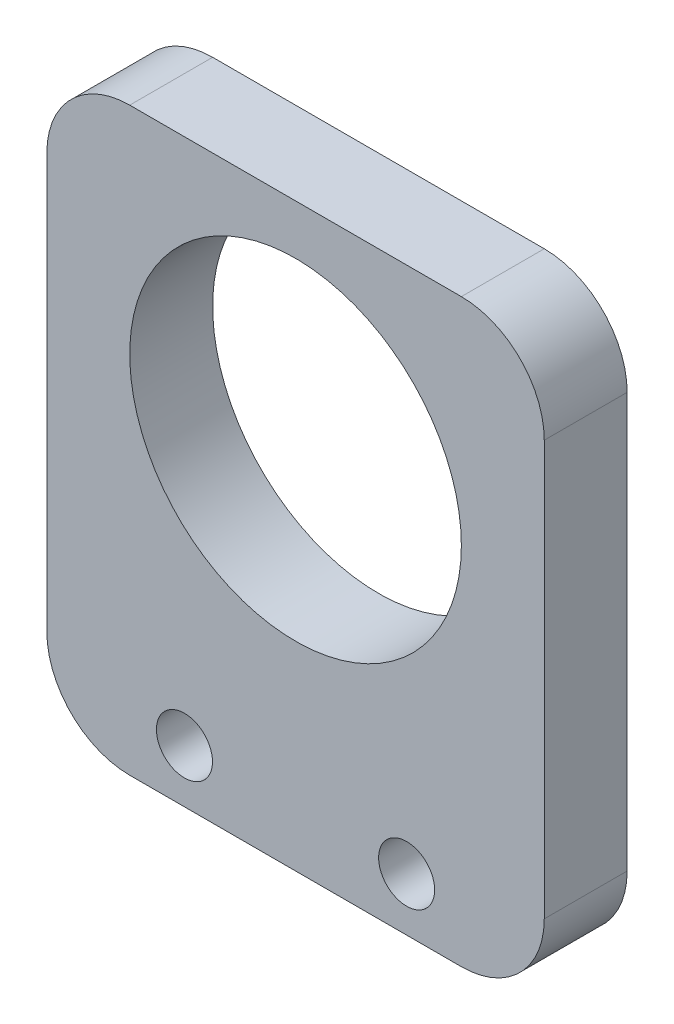
ISO-10303-21;
HEADER;
FILE_DESCRIPTION(('STEP AP214'),'2;1');
FILE_NAME('part.step','',(''),(''),'','','');
FILE_SCHEMA(('AUTOMOTIVE_DESIGN { 1 0 10303 214 1 1 1 1 }'));
ENDSEC;
DATA;
#1=APPLICATION_CONTEXT('core data for automotive mechanical design processes');
#2=APPLICATION_PROTOCOL_DEFINITION('international standard','automotive_design',2000,#1);
#3=PRODUCT_CONTEXT('',#1,'mechanical');
#4=PRODUCT('Part','Part','',(#3));
#5=PRODUCT_RELATED_PRODUCT_CATEGORY('part','',(#4));
#6=PRODUCT_DEFINITION_FORMATION('','',#4);
#7=PRODUCT_DEFINITION_CONTEXT('part definition',#1,'design');
#8=PRODUCT_DEFINITION('design','',#6,#7);
#9=PRODUCT_DEFINITION_SHAPE('','',#8);
#10=(LENGTH_UNIT() NAMED_UNIT(*) SI_UNIT(.MILLI.,.METRE.));
#11=(NAMED_UNIT(*) PLANE_ANGLE_UNIT() SI_UNIT($,.RADIAN.));
#12=(NAMED_UNIT(*) SI_UNIT($,.STERADIAN.) SOLID_ANGLE_UNIT());
#13=UNCERTAINTY_MEASURE_WITH_UNIT(LENGTH_MEASURE(1.E-05),#10,'distance_accuracy_value','');
#14=(GEOMETRIC_REPRESENTATION_CONTEXT(3) GLOBAL_UNCERTAINTY_ASSIGNED_CONTEXT((#13)) GLOBAL_UNIT_ASSIGNED_CONTEXT((#10,
#11,#12)) REPRESENTATION_CONTEXT('',''));
#15=CARTESIAN_POINT('',(0.,0.,0.));
#16=DIRECTION('',(0.,0.,1.));
#17=DIRECTION('',(1.,0.,0.));
#18=AXIS2_PLACEMENT_3D('',#15,#16,#17);
#19=CARTESIAN_POINT('',(0.,0.,6.35));
#20=DIRECTION('',(0.,0.,1.));
#21=DIRECTION('',(1.,0.,0.));
#22=AXIS2_PLACEMENT_3D('',#19,#20,#21);
#23=PLANE('',#22);
#24=CARTESIAN_POINT('',(8.50899999999999,4.064,6.35));
#25=DIRECTION('',(0.,0.,1.));
#26=DIRECTION('',(1.,0.,0.));
#27=AXIS2_PLACEMENT_3D('',#24,#25,#26);
#28=CIRCLE('',#27,2.1463);
#29=CARTESIAN_POINT('',(10.6553,4.064,6.35));
#30=VERTEX_POINT('',#29);
#31=EDGE_CURVE('E183',#30,#30,#28,.T.);
#32=ORIENTED_EDGE('',*,*,#31,.F.);
#33=EDGE_LOOP('',(#32));
#34=FACE_BOUND('',#33,.T.);
#35=DIRECTION('',(-1.,0.,0.));
#36=VECTOR('',#35,1.);
#37=CARTESIAN_POINT('',(19.05,44.45,6.35));
#38=LINE('',#37,#36);
#39=CARTESIAN_POINT('',(12.7,44.45,6.35));
#40=VERTEX_POINT('',#39);
#41=CARTESIAN_POINT('',(-12.7,44.45,6.35));
#42=VERTEX_POINT('',#41);
#43=EDGE_CURVE('E169',#40,#42,#38,.T.);
#44=ORIENTED_EDGE('',*,*,#43,.T.);
#45=CARTESIAN_POINT('',(-12.7,38.1,6.35));
#46=DIRECTION('',(0.,0.,1.));
#47=DIRECTION('',(1.,0.,0.));
#48=AXIS2_PLACEMENT_3D('',#45,#46,#47);
#49=CIRCLE('',#48,6.35);
#50=CARTESIAN_POINT('',(-19.05,38.1,6.35));
#51=VERTEX_POINT('',#50);
#52=EDGE_CURVE('E150',#42,#51,#49,.T.);
#53=ORIENTED_EDGE('',*,*,#52,.T.);
#54=DIRECTION('',(0.,-1.,0.));
#55=VECTOR('',#54,1.);
#56=CARTESIAN_POINT('',(-19.05,0.,6.35));
#57=LINE('',#56,#55);
#58=CARTESIAN_POINT('',(-19.05,6.35,6.35));
#59=VERTEX_POINT('',#58);
#60=EDGE_CURVE('E120',#51,#59,#57,.T.);
#61=ORIENTED_EDGE('',*,*,#60,.T.);
#62=CARTESIAN_POINT('',(-12.7,6.35,6.35));
#63=DIRECTION('',(0.,0.,1.));
#64=DIRECTION('',(1.,0.,0.));
#65=AXIS2_PLACEMENT_3D('',#62,#63,#64);
#66=CIRCLE('',#65,6.35);
#67=CARTESIAN_POINT('',(-12.7,0.,6.35));
#68=VERTEX_POINT('',#67);
#69=EDGE_CURVE('E56',#59,#68,#66,.T.);
#70=ORIENTED_EDGE('',*,*,#69,.T.);
#71=DIRECTION('',(1.,0.,0.));
#72=VECTOR('',#71,1.);
#73=CARTESIAN_POINT('',(-19.05,0.,6.35));
#74=LINE('',#73,#72);
#75=CARTESIAN_POINT('',(12.7,0.,6.35));
#76=VERTEX_POINT('',#75);
#77=EDGE_CURVE('E136',#68,#76,#74,.T.);
#78=ORIENTED_EDGE('',*,*,#77,.T.);
#79=CARTESIAN_POINT('',(12.7,6.35,6.35));
#80=DIRECTION('',(0.,0.,1.));
#81=DIRECTION('',(1.,0.,0.));
#82=AXIS2_PLACEMENT_3D('',#79,#80,#81);
#83=CIRCLE('',#82,6.35);
#84=CARTESIAN_POINT('',(19.05,6.35,6.35));
#85=VERTEX_POINT('',#84);
#86=EDGE_CURVE('E147',#76,#85,#83,.T.);
#87=ORIENTED_EDGE('',*,*,#86,.T.);
#88=DIRECTION('',(0.,1.,0.));
#89=VECTOR('',#88,1.);
#90=CARTESIAN_POINT('',(19.05,0.,6.35));
#91=LINE('',#90,#89);
#92=CARTESIAN_POINT('',(19.05,38.1,6.35));
#93=VERTEX_POINT('',#92);
#94=EDGE_CURVE('E130',#85,#93,#91,.T.);
#95=ORIENTED_EDGE('',*,*,#94,.T.);
#96=CARTESIAN_POINT('',(12.7,38.1,6.35));
#97=DIRECTION('',(0.,0.,1.));
#98=DIRECTION('',(1.,0.,0.));
#99=AXIS2_PLACEMENT_3D('',#96,#97,#98);
#100=CIRCLE('',#99,6.35);
#101=EDGE_CURVE('E145',#93,#40,#100,.T.);
#102=ORIENTED_EDGE('',*,*,#101,.T.);
#103=EDGE_LOOP('',(#44,#53,#61,#70,#78,#87,#95,#102));
#104=FACE_BOUND('',#103,.T.);
#105=CARTESIAN_POINT('',(1.11022302462516E-13,27.9399999999997,6.35));
#106=DIRECTION('',(0.,0.,1.));
#107=DIRECTION('',(1.,0.,0.));
#108=AXIS2_PLACEMENT_3D('',#105,#106,#107);
#109=CIRCLE('',#108,12.6999999999999);
#110=CARTESIAN_POINT('',(12.7,27.9399999999997,6.35));
#111=VERTEX_POINT('',#110);
#112=EDGE_CURVE('E174',#111,#111,#109,.T.);
#113=ORIENTED_EDGE('',*,*,#112,.F.);
#114=EDGE_LOOP('',(#113));
#115=FACE_BOUND('',#114,.T.);
#116=CARTESIAN_POINT('',(-8.50900000000001,4.064,6.35));
#117=DIRECTION('',(0.,0.,1.));
#118=DIRECTION('',(1.,0.,0.));
#119=AXIS2_PLACEMENT_3D('',#116,#117,#118);
#120=CIRCLE('',#119,2.1463);
#121=CARTESIAN_POINT('',(-6.36270000000001,4.064,6.35));
#122=VERTEX_POINT('',#121);
#123=EDGE_CURVE('E188',#122,#122,#120,.T.);
#124=ORIENTED_EDGE('',*,*,#123,.F.);
#125=EDGE_LOOP('',(#124));
#126=FACE_BOUND('',#125,.T.);
#127=ADVANCED_FACE('F34',(#34,#104,#115,#126),#23,.T.);
#128=CARTESIAN_POINT('',(0.,0.,0.));
#129=DIRECTION('',(0.,0.,1.));
#130=DIRECTION('',(1.,0.,0.));
#131=AXIS2_PLACEMENT_3D('',#128,#129,#130);
#132=PLANE('',#131);
#133=DIRECTION('',(0.,-1.,0.));
#134=VECTOR('',#133,1.);
#135=CARTESIAN_POINT('',(-19.05,0.,0.));
#136=LINE('',#135,#134);
#137=CARTESIAN_POINT('',(-19.05,38.1,0.));
#138=VERTEX_POINT('',#137);
#139=CARTESIAN_POINT('',(-19.05,6.35,0.));
#140=VERTEX_POINT('',#139);
#141=EDGE_CURVE('E118',#138,#140,#136,.T.);
#142=ORIENTED_EDGE('',*,*,#141,.F.);
#143=CARTESIAN_POINT('',(-12.7,38.1,0.));
#144=DIRECTION('',(0.,0.,1.));
#145=DIRECTION('',(1.,0.,0.));
#146=AXIS2_PLACEMENT_3D('',#143,#144,#145);
#147=CIRCLE('',#146,6.35);
#148=CARTESIAN_POINT('',(-12.7,44.45,0.));
#149=VERTEX_POINT('',#148);
#150=EDGE_CURVE('E101',#138,#149,#147,.F.);
#151=ORIENTED_EDGE('',*,*,#150,.T.);
#152=DIRECTION('',(-1.,0.,0.));
#153=VECTOR('',#152,1.);
#154=CARTESIAN_POINT('',(19.05,44.45,0.));
#155=LINE('',#154,#153);
#156=CARTESIAN_POINT('',(12.7,44.45,0.));
#157=VERTEX_POINT('',#156);
#158=EDGE_CURVE('E128',#157,#149,#155,.T.);
#159=ORIENTED_EDGE('',*,*,#158,.F.);
#160=CARTESIAN_POINT('',(12.7,38.1,0.));
#161=DIRECTION('',(0.,0.,1.));
#162=DIRECTION('',(1.,0.,0.));
#163=AXIS2_PLACEMENT_3D('',#160,#161,#162);
#164=CIRCLE('',#163,6.35);
#165=CARTESIAN_POINT('',(19.05,38.1,0.));
#166=VERTEX_POINT('',#165);
#167=EDGE_CURVE('E121',#157,#166,#164,.F.);
#168=ORIENTED_EDGE('',*,*,#167,.T.);
#169=DIRECTION('',(0.,1.,0.));
#170=VECTOR('',#169,1.);
#171=CARTESIAN_POINT('',(19.05,0.,0.));
#172=LINE('',#171,#170);
#173=CARTESIAN_POINT('',(19.05,6.35,0.));
#174=VERTEX_POINT('',#173);
#175=EDGE_CURVE('E132',#174,#166,#172,.T.);
#176=ORIENTED_EDGE('',*,*,#175,.F.);
#177=CARTESIAN_POINT('',(12.7,6.35,0.));
#178=DIRECTION('',(0.,0.,1.));
#179=DIRECTION('',(1.,0.,0.));
#180=AXIS2_PLACEMENT_3D('',#177,#178,#179);
#181=CIRCLE('',#180,6.35);
#182=CARTESIAN_POINT('',(12.7,0.,0.));
#183=VERTEX_POINT('',#182);
#184=EDGE_CURVE('E139',#174,#183,#181,.F.);
#185=ORIENTED_EDGE('',*,*,#184,.T.);
#186=DIRECTION('',(1.,0.,0.));
#187=VECTOR('',#186,1.);
#188=CARTESIAN_POINT('',(-19.05,0.,0.));
#189=LINE('',#188,#187);
#190=CARTESIAN_POINT('',(-12.7,0.,0.));
#191=VERTEX_POINT('',#190);
#192=EDGE_CURVE('E127',#191,#183,#189,.T.);
#193=ORIENTED_EDGE('',*,*,#192,.F.);
#194=CARTESIAN_POINT('',(-12.7,6.35,0.));
#195=DIRECTION('',(0.,0.,1.));
#196=DIRECTION('',(1.,0.,0.));
#197=AXIS2_PLACEMENT_3D('',#194,#195,#196);
#198=CIRCLE('',#197,6.35);
#199=EDGE_CURVE('E112',#191,#140,#198,.F.);
#200=ORIENTED_EDGE('',*,*,#199,.T.);
#201=EDGE_LOOP('',(#142,#151,#159,#168,#176,#185,#193,#200));
#202=FACE_BOUND('',#201,.T.);
#203=CARTESIAN_POINT('',(1.11022302462516E-13,27.9399999999997,0.));
#204=DIRECTION('',(0.,0.,1.));
#205=DIRECTION('',(1.,0.,0.));
#206=AXIS2_PLACEMENT_3D('',#203,#204,#205);
#207=CIRCLE('',#206,12.6999999999999);
#208=CARTESIAN_POINT('',(12.7,27.9399999999997,0.));
#209=VERTEX_POINT('',#208);
#210=EDGE_CURVE('E176',#209,#209,#207,.T.);
#211=ORIENTED_EDGE('',*,*,#210,.T.);
#212=EDGE_LOOP('',(#211));
#213=FACE_BOUND('',#212,.T.);
#214=CARTESIAN_POINT('',(8.50899999999999,4.064,0.));
#215=DIRECTION('',(0.,0.,1.));
#216=DIRECTION('',(1.,0.,0.));
#217=AXIS2_PLACEMENT_3D('',#214,#215,#216);
#218=CIRCLE('',#217,2.1463);
#219=CARTESIAN_POINT('',(10.6553,4.064,0.));
#220=VERTEX_POINT('',#219);
#221=EDGE_CURVE('E185',#220,#220,#218,.T.);
#222=ORIENTED_EDGE('',*,*,#221,.T.);
#223=EDGE_LOOP('',(#222));
#224=FACE_BOUND('',#223,.T.);
#225=CARTESIAN_POINT('',(-8.50900000000001,4.064,0.));
#226=DIRECTION('',(0.,0.,1.));
#227=DIRECTION('',(1.,0.,0.));
#228=AXIS2_PLACEMENT_3D('',#225,#226,#227);
#229=CIRCLE('',#228,2.1463);
#230=CARTESIAN_POINT('',(-6.36270000000001,4.064,0.));
#231=VERTEX_POINT('',#230);
#232=EDGE_CURVE('E191',#231,#231,#229,.T.);
#233=ORIENTED_EDGE('',*,*,#232,.T.);
#234=EDGE_LOOP('',(#233));
#235=FACE_BOUND('',#234,.T.);
#236=ADVANCED_FACE('F124',(#202,#213,#224,#235),#132,.F.);
#237=CARTESIAN_POINT('',(19.05,0.,6.35));
#238=DIRECTION('',(-1.,0.,0.));
#239=DIRECTION('',(0.,0.,1.));
#240=AXIS2_PLACEMENT_3D('',#237,#238,#239);
#241=PLANE('',#240);
#242=ORIENTED_EDGE('',*,*,#94,.F.);
#243=DIRECTION('',(0.,0.,-1.));
#244=VECTOR('',#243,1.);
#245=CARTESIAN_POINT('',(19.05,6.35,6.35));
#246=LINE('',#245,#244);
#247=EDGE_CURVE('E11',#85,#174,#246,.T.);
#248=ORIENTED_EDGE('',*,*,#247,.T.);
#249=ORIENTED_EDGE('',*,*,#175,.T.);
#250=DIRECTION('',(0.,0.,-1.));
#251=VECTOR('',#250,1.);
#252=CARTESIAN_POINT('',(19.05,38.1,6.35));
#253=LINE('',#252,#251);
#254=EDGE_CURVE('E42',#166,#93,#253,.F.);
#255=ORIENTED_EDGE('',*,*,#254,.T.);
#256=EDGE_LOOP('',(#242,#248,#249,#255));
#257=FACE_BOUND('',#256,.T.);
#258=ADVANCED_FACE('F160',(#257),#241,.F.);
#259=CARTESIAN_POINT('',(19.05,44.45,6.35));
#260=DIRECTION('',(0.,-1.,0.));
#261=DIRECTION('',(0.,0.,-1.));
#262=AXIS2_PLACEMENT_3D('',#259,#260,#261);
#263=PLANE('',#262);
#264=ORIENTED_EDGE('',*,*,#158,.T.);
#265=DIRECTION('',(0.,0.,-1.));
#266=VECTOR('',#265,1.);
#267=CARTESIAN_POINT('',(-12.7,44.45,6.35));
#268=LINE('',#267,#266);
#269=EDGE_CURVE('E106',#149,#42,#268,.F.);
#270=ORIENTED_EDGE('',*,*,#269,.T.);
#271=ORIENTED_EDGE('',*,*,#43,.F.);
#272=DIRECTION('',(0.,0.,-1.));
#273=VECTOR('',#272,1.);
#274=CARTESIAN_POINT('',(12.7,44.45,6.35));
#275=LINE('',#274,#273);
#276=EDGE_CURVE('E111',#40,#157,#275,.T.);
#277=ORIENTED_EDGE('',*,*,#276,.T.);
#278=EDGE_LOOP('',(#264,#270,#271,#277));
#279=FACE_BOUND('',#278,.T.);
#280=ADVANCED_FACE('F173',(#279),#263,.F.);
#281=CARTESIAN_POINT('',(-19.05,0.,6.35));
#282=DIRECTION('',(1.,0.,0.));
#283=DIRECTION('',(0.,0.,-1.));
#284=AXIS2_PLACEMENT_3D('',#281,#282,#283);
#285=PLANE('',#284);
#286=ORIENTED_EDGE('',*,*,#60,.F.);
#287=DIRECTION('',(0.,0.,-1.));
#288=VECTOR('',#287,1.);
#289=CARTESIAN_POINT('',(-19.05,38.1,6.35));
#290=LINE('',#289,#288);
#291=EDGE_CURVE('E105',#51,#138,#290,.T.);
#292=ORIENTED_EDGE('',*,*,#291,.T.);
#293=ORIENTED_EDGE('',*,*,#141,.T.);
#294=DIRECTION('',(0.,0.,-1.));
#295=VECTOR('',#294,1.);
#296=CARTESIAN_POINT('',(-19.05,6.35,6.35));
#297=LINE('',#296,#295);
#298=EDGE_CURVE('E122',#140,#59,#297,.F.);
#299=ORIENTED_EDGE('',*,*,#298,.T.);
#300=EDGE_LOOP('',(#286,#292,#293,#299));
#301=FACE_BOUND('',#300,.T.);
#302=ADVANCED_FACE('F117',(#301),#285,.F.);
#303=CARTESIAN_POINT('',(-19.05,0.,6.35));
#304=DIRECTION('',(0.,1.,0.));
#305=DIRECTION('',(-1.,0.,0.));
#306=AXIS2_PLACEMENT_3D('',#303,#304,#305);
#307=PLANE('',#306);
#308=ORIENTED_EDGE('',*,*,#77,.F.);
#309=DIRECTION('',(0.,0.,-1.));
#310=VECTOR('',#309,1.);
#311=CARTESIAN_POINT('',(-12.7,0.,6.35));
#312=LINE('',#311,#310);
#313=EDGE_CURVE('E153',#68,#191,#312,.T.);
#314=ORIENTED_EDGE('',*,*,#313,.T.);
#315=ORIENTED_EDGE('',*,*,#192,.T.);
#316=DIRECTION('',(0.,0.,-1.));
#317=VECTOR('',#316,1.);
#318=CARTESIAN_POINT('',(12.7,0.,6.35));
#319=LINE('',#318,#317);
#320=EDGE_CURVE('E49',#183,#76,#319,.F.);
#321=ORIENTED_EDGE('',*,*,#320,.T.);
#322=EDGE_LOOP('',(#308,#314,#315,#321));
#323=FACE_BOUND('',#322,.T.);
#324=ADVANCED_FACE('F212',(#323),#307,.F.);
#325=CARTESIAN_POINT('',(1.11022302462516E-13,27.9399999999997,6.35));
#326=DIRECTION('',(0.,0.,-1.));
#327=DIRECTION('',(-1.,0.,0.));
#328=AXIS2_PLACEMENT_3D('',#325,#326,#327);
#329=CYLINDRICAL_SURFACE('',#328,12.6999999999999);
#330=ORIENTED_EDGE('',*,*,#112,.T.);
#331=EDGE_LOOP('',(#330));
#332=FACE_BOUND('',#331,.T.);
#333=ORIENTED_EDGE('',*,*,#210,.F.);
#334=EDGE_LOOP('',(#333));
#335=FACE_BOUND('',#334,.T.);
#336=ADVANCED_FACE('F209',(#332,#335),#329,.F.);
#337=CARTESIAN_POINT('',(8.50899999999999,4.064,6.35));
#338=DIRECTION('',(0.,0.,-1.));
#339=DIRECTION('',(-1.,0.,0.));
#340=AXIS2_PLACEMENT_3D('',#337,#338,#339);
#341=CYLINDRICAL_SURFACE('',#340,2.1463);
#342=ORIENTED_EDGE('',*,*,#31,.T.);
#343=EDGE_LOOP('',(#342));
#344=FACE_BOUND('',#343,.T.);
#345=ORIENTED_EDGE('',*,*,#221,.F.);
#346=EDGE_LOOP('',(#345));
#347=FACE_BOUND('',#346,.T.);
#348=ADVANCED_FACE('F295',(#344,#347),#341,.F.);
#349=CARTESIAN_POINT('',(-8.50900000000001,4.064,6.35));
#350=DIRECTION('',(0.,0.,-1.));
#351=DIRECTION('',(-1.,0.,0.));
#352=AXIS2_PLACEMENT_3D('',#349,#350,#351);
#353=CYLINDRICAL_SURFACE('',#352,2.1463);
#354=ORIENTED_EDGE('',*,*,#123,.T.);
#355=EDGE_LOOP('',(#354));
#356=FACE_BOUND('',#355,.T.);
#357=ORIENTED_EDGE('',*,*,#232,.F.);
#358=EDGE_LOOP('',(#357));
#359=FACE_BOUND('',#358,.T.);
#360=ADVANCED_FACE('F197',(#356,#359),#353,.F.);
#361=CARTESIAN_POINT('',(-12.7,38.1,6.35));
#362=DIRECTION('',(0.,0.,-1.));
#363=DIRECTION('',(-1.,0.,0.));
#364=AXIS2_PLACEMENT_3D('',#361,#362,#363);
#365=CYLINDRICAL_SURFACE('',#364,6.35);
#366=ORIENTED_EDGE('',*,*,#52,.F.);
#367=ORIENTED_EDGE('',*,*,#269,.F.);
#368=ORIENTED_EDGE('',*,*,#150,.F.);
#369=ORIENTED_EDGE('',*,*,#291,.F.);
#370=EDGE_LOOP('',(#366,#367,#368,#369));
#371=FACE_BOUND('',#370,.T.);
#372=ADVANCED_FACE('F104',(#371),#365,.T.);
#373=CARTESIAN_POINT('',(-12.7,6.35,6.35));
#374=DIRECTION('',(0.,0.,-1.));
#375=DIRECTION('',(-1.,0.,0.));
#376=AXIS2_PLACEMENT_3D('',#373,#374,#375);
#377=CYLINDRICAL_SURFACE('',#376,6.35);
#378=ORIENTED_EDGE('',*,*,#69,.F.);
#379=ORIENTED_EDGE('',*,*,#298,.F.);
#380=ORIENTED_EDGE('',*,*,#199,.F.);
#381=ORIENTED_EDGE('',*,*,#313,.F.);
#382=EDGE_LOOP('',(#378,#379,#380,#381));
#383=FACE_BOUND('',#382,.T.);
#384=ADVANCED_FACE('F223',(#383),#377,.T.);
#385=CARTESIAN_POINT('',(12.7,6.35,6.35));
#386=DIRECTION('',(0.,0.,-1.));
#387=DIRECTION('',(-1.,0.,0.));
#388=AXIS2_PLACEMENT_3D('',#385,#386,#387);
#389=CYLINDRICAL_SURFACE('',#388,6.35);
#390=ORIENTED_EDGE('',*,*,#86,.F.);
#391=ORIENTED_EDGE('',*,*,#320,.F.);
#392=ORIENTED_EDGE('',*,*,#184,.F.);
#393=ORIENTED_EDGE('',*,*,#247,.F.);
#394=EDGE_LOOP('',(#390,#391,#392,#393));
#395=FACE_BOUND('',#394,.T.);
#396=ADVANCED_FACE('F225',(#395),#389,.T.);
#397=CARTESIAN_POINT('',(12.7,38.1,6.35));
#398=DIRECTION('',(0.,0.,-1.));
#399=DIRECTION('',(-1.,0.,0.));
#400=AXIS2_PLACEMENT_3D('',#397,#398,#399);
#401=CYLINDRICAL_SURFACE('',#400,6.35);
#402=ORIENTED_EDGE('',*,*,#101,.F.);
#403=ORIENTED_EDGE('',*,*,#254,.F.);
#404=ORIENTED_EDGE('',*,*,#167,.F.);
#405=ORIENTED_EDGE('',*,*,#276,.F.);
#406=EDGE_LOOP('',(#402,#403,#404,#405));
#407=FACE_BOUND('',#406,.T.);
#408=ADVANCED_FACE('F36',(#407),#401,.T.);
#409=CLOSED_SHELL('',(#127,#236,#258,#280,#302,#324,#336,#348,#360,#372,#384,#396,#408));
#410=MANIFOLD_SOLID_BREP('B2',#409);
#411=ADVANCED_BREP_SHAPE_REPRESENTATION('',(#18,#410),#14);
#412=SHAPE_DEFINITION_REPRESENTATION(#9,#411);
ENDSEC;
END-ISO-10303-21;
